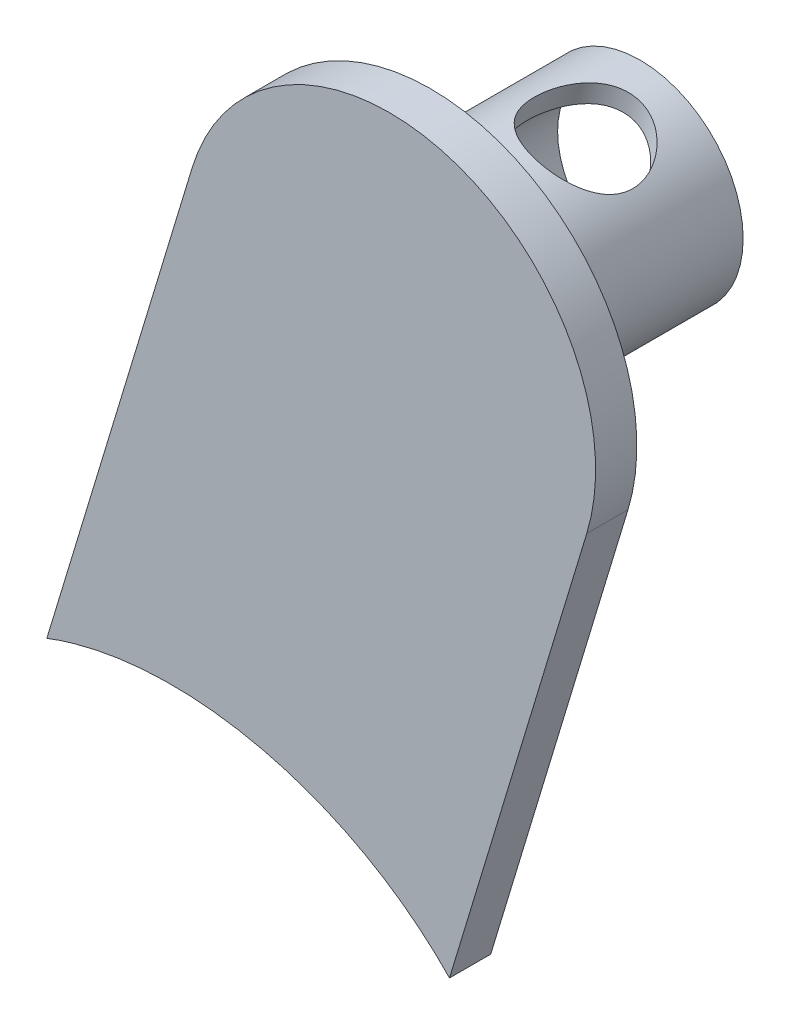
ISO-10303-21;
HEADER;
FILE_DESCRIPTION(('STEP AP214'),'2;1');
FILE_NAME('part.step','',(''),(''),'','','');
FILE_SCHEMA(('AUTOMOTIVE_DESIGN { 1 0 10303 214 1 1 1 1 }'));
ENDSEC;
DATA;
#1=APPLICATION_CONTEXT('core data for automotive mechanical design processes');
#2=APPLICATION_PROTOCOL_DEFINITION('international standard','automotive_design',2000,#1);
#3=PRODUCT_CONTEXT('',#1,'mechanical');
#4=PRODUCT('Part','Part','',(#3));
#5=PRODUCT_RELATED_PRODUCT_CATEGORY('part','',(#4));
#6=PRODUCT_DEFINITION_FORMATION('','',#4);
#7=PRODUCT_DEFINITION_CONTEXT('part definition',#1,'design');
#8=PRODUCT_DEFINITION('design','',#6,#7);
#9=PRODUCT_DEFINITION_SHAPE('','',#8);
#10=(LENGTH_UNIT() NAMED_UNIT(*) SI_UNIT(.MILLI.,.METRE.));
#11=(NAMED_UNIT(*) PLANE_ANGLE_UNIT() SI_UNIT($,.RADIAN.));
#12=(NAMED_UNIT(*) SI_UNIT($,.STERADIAN.) SOLID_ANGLE_UNIT());
#13=UNCERTAINTY_MEASURE_WITH_UNIT(LENGTH_MEASURE(1.E-05),#10,'distance_accuracy_value','');
#14=(GEOMETRIC_REPRESENTATION_CONTEXT(3) GLOBAL_UNCERTAINTY_ASSIGNED_CONTEXT((#13)) GLOBAL_UNIT_ASSIGNED_CONTEXT((#10,
#11,#12)) REPRESENTATION_CONTEXT('',''));
#15=CARTESIAN_POINT('',(0.,0.,0.));
#16=DIRECTION('',(0.,0.,1.));
#17=DIRECTION('',(1.,0.,0.));
#18=AXIS2_PLACEMENT_3D('',#15,#16,#17);
#19=CARTESIAN_POINT('',(1209.34523860419,-251.377000383089,615.999346088971));
#20=CARTESIAN_POINT('',(1202.97437345163,-275.551616764902,615.999346088971));
#21=CARTESIAN_POINT('',(1233.28038668328,-283.53832152006,615.999346088971));
#22=CARTESIAN_POINT('',(1239.65125183585,-259.363705138247,615.999346088971));
#23=CARTESIAN_POINT('',(1246.02211698841,-235.189088756434,615.999346088971));
#24=CARTESIAN_POINT('',(1215.71610375676,-227.202384001276,615.999346088971));
#25=CARTESIAN_POINT('',(1209.34523860419,-251.377000383089,615.999346088971));
#26=(BOUNDED_CURVE() B_SPLINE_CURVE(3,(#19,#20,#21,#22,#23,#24,#25),.UNSPECIFIED.,.T.,
.F.) B_SPLINE_CURVE_WITH_KNOTS((4,3,4),(0.,0.5,1.),
.UNSPECIFIED.) CURVE() GEOMETRIC_REPRESENTATION_ITEM() RATIONAL_B_SPLINE_CURVE((1.,
0.333333333333333,0.333333333333333,1.,0.333333333333333,0.333333333333333,1.)) REPRESENTATION_ITEM(''));
#27=DIRECTION('',(0.,0.,1.));
#28=VECTOR('',#27,1.);
#29=SURFACE_OF_LINEAR_EXTRUSION('',#26,#28);
#30=CARTESIAN_POINT('',(1209.34523860419,-251.377000383089,617.999346088971));
#31=CARTESIAN_POINT('',(1202.97437345163,-275.551616764902,617.999346088971));
#32=CARTESIAN_POINT('',(1233.28038668328,-283.53832152006,617.999346088971));
#33=CARTESIAN_POINT('',(1239.65125183585,-259.363705138247,617.999346088971));
#34=CARTESIAN_POINT('',(1246.02211698841,-235.189088756434,617.999346088971));
#35=CARTESIAN_POINT('',(1215.71610375676,-227.202384001276,617.999346088971));
#36=CARTESIAN_POINT('',(1209.34523860419,-251.377000383089,617.999346088971));
#37=(BOUNDED_CURVE() B_SPLINE_CURVE(3,(#30,#31,#32,#33,#34,#35,#36),.UNSPECIFIED.,.T.,
.F.) B_SPLINE_CURVE_WITH_KNOTS((4,3,4),(0.,0.5,1.),
.UNSPECIFIED.) CURVE() GEOMETRIC_REPRESENTATION_ITEM() RATIONAL_B_SPLINE_CURVE((1.,
0.333333333333333,0.333333333333333,1.,0.333333333333333,0.333333333333333,1.)) REPRESENTATION_ITEM(''));
#38=CARTESIAN_POINT('',(1236.2588408996,-248.221098890482,617.999346088971));
#39=VERTEX_POINT('',#38);
#40=CARTESIAN_POINT('',(1216.72659095181,-243.715486457987,617.999346088971));
#41=VERTEX_POINT('',#40);
#42=EDGE_CURVE('E115',#39,#41,#37,.T.);
#43=ORIENTED_EDGE('',*,*,#42,.T.);
#44=DIRECTION('',(0.,0.,1.));
#45=VECTOR('',#44,1.);
#46=CARTESIAN_POINT('',(1216.72659095181,-243.715486457987,615.999346088971));
#47=LINE('',#46,#45);
#48=CARTESIAN_POINT('',(1216.72659095181,-243.715486457987,615.999346088971));
#49=VERTEX_POINT('',#48);
#50=EDGE_CURVE('E57',#49,#41,#47,.T.);
#51=ORIENTED_EDGE('',*,*,#50,.F.);
#52=CARTESIAN_POINT('',(1236.2588408996,-248.221098890482,615.999346088971));
#53=VERTEX_POINT('',#52);
#54=EDGE_CURVE('E102',#53,#49,#26,.T.);
#55=ORIENTED_EDGE('',*,*,#54,.F.);
#56=DIRECTION('',(0.,0.,1.));
#57=VECTOR('',#56,1.);
#58=CARTESIAN_POINT('',(1236.2588408996,-248.221098890482,615.999346088971));
#59=LINE('',#58,#57);
#60=EDGE_CURVE('E112',#53,#39,#59,.T.);
#61=ORIENTED_EDGE('',*,*,#60,.T.);
#62=EDGE_LOOP('',(#43,#51,#55,#61));
#63=FACE_BOUND('',#62,.T.);
#64=ADVANCED_FACE('F42',(#63),#29,.F.);
#65=CARTESIAN_POINT('',(1216.72659095181,-243.715486457987,615.999346088971));
#66=DIRECTION('',(0.957131671562847,-0.289653177595742,0.));
#67=DIRECTION('',(0.289653177595742,0.957131671562847,0.));
#68=AXIS2_PLACEMENT_3D('',#65,#66,#67);
#69=PLANE('',#68);
#70=DIRECTION('',(0.289653177595742,0.957131671562847,0.));
#71=VECTOR('',#70,1.);
#72=CARTESIAN_POINT('',(1216.72659095181,-243.715486457987,617.999346088971));
#73=LINE('',#72,#71);
#74=CARTESIAN_POINT('',(1223.77520656495,-220.423999376747,617.999346088971));
#75=VERTEX_POINT('',#74);
#76=EDGE_CURVE('E107',#41,#75,#73,.T.);
#77=ORIENTED_EDGE('',*,*,#76,.T.);
#78=DIRECTION('',(0.,0.,1.));
#79=VECTOR('',#78,1.);
#80=CARTESIAN_POINT('',(1223.77520656495,-220.423999376747,615.999346088971));
#81=LINE('',#80,#79);
#82=CARTESIAN_POINT('',(1223.77520656495,-220.423999376747,615.999346088971));
#83=VERTEX_POINT('',#82);
#84=EDGE_CURVE('E105',#83,#75,#81,.T.);
#85=ORIENTED_EDGE('',*,*,#84,.F.);
#86=DIRECTION('',(0.289653177595742,0.957131671562847,0.));
#87=VECTOR('',#86,1.);
#88=CARTESIAN_POINT('',(1216.72659095181,-243.715486457987,615.999346088971));
#89=LINE('',#88,#87);
#90=EDGE_CURVE('E97',#49,#83,#89,.T.);
#91=ORIENTED_EDGE('',*,*,#90,.F.);
#92=ORIENTED_EDGE('',*,*,#50,.T.);
#93=EDGE_LOOP('',(#77,#85,#91,#92));
#94=FACE_BOUND('',#93,.T.);
#95=ADVANCED_FACE('F106',(#94),#69,.F.);
#96=CARTESIAN_POINT('',(1233.34652328058,-223.320531152704,615.999346088971));
#97=DIRECTION('',(0.,0.,1.));
#98=DIRECTION('',(1.,0.,0.));
#99=AXIS2_PLACEMENT_3D('',#96,#97,#98);
#100=CYLINDRICAL_SURFACE('',#99,10.0000000000004);
#101=CARTESIAN_POINT('',(1233.34652328058,-223.320531152704,617.999346088971));
#102=DIRECTION('',(0.,0.,-1.));
#103=DIRECTION('',(1.,0.,0.));
#104=AXIS2_PLACEMENT_3D('',#101,#102,#103);
#105=CIRCLE('',#104,10.0000000000004);
#106=CARTESIAN_POINT('',(1242.91783999621,-226.217062928662,617.999346088971));
#107=VERTEX_POINT('',#106);
#108=EDGE_CURVE('E83',#75,#107,#105,.T.);
#109=ORIENTED_EDGE('',*,*,#108,.T.);
#110=DIRECTION('',(0.,0.,1.));
#111=VECTOR('',#110,1.);
#112=CARTESIAN_POINT('',(1242.91783999621,-226.217062928662,615.999346088971));
#113=LINE('',#112,#111);
#114=CARTESIAN_POINT('',(1242.91783999621,-226.217062928662,615.999346088971));
#115=VERTEX_POINT('',#114);
#116=EDGE_CURVE('E108',#115,#107,#113,.T.);
#117=ORIENTED_EDGE('',*,*,#116,.F.);
#118=CARTESIAN_POINT('',(1233.34652328058,-223.320531152704,615.999346088971));
#119=DIRECTION('',(0.,0.,-1.));
#120=DIRECTION('',(1.,0.,0.));
#121=AXIS2_PLACEMENT_3D('',#118,#119,#120);
#122=CIRCLE('',#121,10.0000000000004);
#123=EDGE_CURVE('E100',#83,#115,#122,.T.);
#124=ORIENTED_EDGE('',*,*,#123,.F.);
#125=ORIENTED_EDGE('',*,*,#84,.T.);
#126=EDGE_LOOP('',(#109,#117,#124,#125));
#127=FACE_BOUND('',#126,.T.);
#128=ADVANCED_FACE('F110',(#127),#100,.T.);
#129=CARTESIAN_POINT('',(1236.2588408996,-248.221098890482,615.999346088971));
#130=DIRECTION('',(-0.957131671562847,0.289653177595743,0.));
#131=DIRECTION('',(-0.289653177595743,-0.957131671562847,0.));
#132=AXIS2_PLACEMENT_3D('',#129,#130,#131);
#133=PLANE('',#132);
#134=DIRECTION('',(-0.289653177595743,-0.957131671562847,0.));
#135=VECTOR('',#134,1.);
#136=CARTESIAN_POINT('',(1236.2588408996,-248.221098890482,617.999346088971));
#137=LINE('',#136,#135);
#138=EDGE_CURVE('E89',#107,#39,#137,.T.);
#139=ORIENTED_EDGE('',*,*,#138,.T.);
#140=ORIENTED_EDGE('',*,*,#60,.F.);
#141=DIRECTION('',(-0.289653177595743,-0.957131671562847,0.));
#142=VECTOR('',#141,1.);
#143=CARTESIAN_POINT('',(1236.2588408996,-248.221098890482,615.999346088971));
#144=LINE('',#143,#142);
#145=EDGE_CURVE('E66',#115,#53,#144,.T.);
#146=ORIENTED_EDGE('',*,*,#145,.F.);
#147=ORIENTED_EDGE('',*,*,#116,.T.);
#148=EDGE_LOOP('',(#139,#140,#146,#147));
#149=FACE_BOUND('',#148,.T.);
#150=ADVANCED_FACE('F168',(#149),#133,.F.);
#151=CARTESIAN_POINT('',(1239.65125183585,-259.363705138247,615.999346088971));
#152=DIRECTION('',(0.,0.,1.));
#153=DIRECTION('',(1.,0.,0.));
#154=AXIS2_PLACEMENT_3D('',#151,#152,#153);
#155=PLANE('',#154);
#156=CARTESIAN_POINT('',(1233.50419133506,-222.034079566292,615.999346088971));
#157=DIRECTION('',(0.,0.,1.));
#158=DIRECTION('',(1.,0.,0.));
#159=AXIS2_PLACEMENT_3D('',#156,#157,#158);
#160=CIRCLE('',#159,4.99999999999999);
#161=CARTESIAN_POINT('',(1238.50419133506,-222.034079566292,615.999346088971));
#162=VERTEX_POINT('',#161);
#163=EDGE_CURVE('E12',#162,#162,#160,.F.);
#164=ORIENTED_EDGE('',*,*,#163,.F.);
#165=EDGE_LOOP('',(#164));
#166=FACE_BOUND('',#165,.T.);
#167=ORIENTED_EDGE('',*,*,#54,.T.);
#168=ORIENTED_EDGE('',*,*,#90,.T.);
#169=ORIENTED_EDGE('',*,*,#123,.T.);
#170=ORIENTED_EDGE('',*,*,#145,.T.);
#171=EDGE_LOOP('',(#167,#168,#169,#170));
#172=FACE_BOUND('',#171,.T.);
#173=ADVANCED_FACE('F98',(#166,#172),#155,.F.);
#174=CARTESIAN_POINT('',(1239.65125183585,-259.363705138247,617.999346088971));
#175=DIRECTION('',(0.,0.,1.));
#176=DIRECTION('',(1.,0.,0.));
#177=AXIS2_PLACEMENT_3D('',#174,#175,#176);
#178=PLANE('',#177);
#179=ORIENTED_EDGE('',*,*,#42,.F.);
#180=ORIENTED_EDGE('',*,*,#138,.F.);
#181=ORIENTED_EDGE('',*,*,#108,.F.);
#182=ORIENTED_EDGE('',*,*,#76,.F.);
#183=EDGE_LOOP('',(#179,#180,#181,#182));
#184=FACE_BOUND('',#183,.T.);
#185=ADVANCED_FACE('F167',(#184),#178,.T.);
#186=CARTESIAN_POINT('',(1233.50419133506,-222.034079566292,605.999346088971));
#187=DIRECTION('',(0.,0.,-1.));
#188=DIRECTION('',(-1.,0.,0.));
#189=AXIS2_PLACEMENT_3D('',#186,#187,#188);
#190=PLANE('',#189);
#191=CARTESIAN_POINT('',(1233.50419133506,-222.034079566292,605.999346088971));
#192=DIRECTION('',(0.,0.,-1.));
#193=DIRECTION('',(-1.,0.,0.));
#194=AXIS2_PLACEMENT_3D('',#191,#192,#193);
#195=CIRCLE('',#194,4.99999999999999);
#196=CARTESIAN_POINT('',(1228.50419133506,-222.034079566292,605.999346088971));
#197=VERTEX_POINT('',#196);
#198=EDGE_CURVE('E120',#197,#197,#195,.T.);
#199=ORIENTED_EDGE('',*,*,#198,.T.);
#200=EDGE_LOOP('',(#199));
#201=FACE_BOUND('',#200,.T.);
#202=CARTESIAN_POINT('',(1233.50419133506,-222.034079566292,605.999346088971));
#203=DIRECTION('',(0.,0.,-1.));
#204=DIRECTION('',(-1.,0.,0.));
#205=AXIS2_PLACEMENT_3D('',#202,#203,#204);
#206=CIRCLE('',#205,3.99999999999999);
#207=CARTESIAN_POINT('',(1229.50419133506,-222.034079566292,605.999346088971));
#208=VERTEX_POINT('',#207);
#209=EDGE_CURVE('E194',#208,#208,#206,.T.);
#210=ORIENTED_EDGE('',*,*,#209,.F.);
#211=EDGE_LOOP('',(#210));
#212=FACE_BOUND('',#211,.T.);
#213=ADVANCED_FACE('F162',(#201,#212),#190,.T.);
#214=CARTESIAN_POINT('',(1233.50419133506,-222.034079566292,605.999346088971));
#215=DIRECTION('',(0.,0.,1.));
#216=DIRECTION('',(1.,0.,0.));
#217=AXIS2_PLACEMENT_3D('',#214,#215,#216);
#218=CYLINDRICAL_SURFACE('',#217,4.99999999999999);
#219=CARTESIAN_POINT('',(1229.85712710573,-225.454448334003,609.999346088971));
#220=CARTESIAN_POINT('',(1229.85713346192,-225.45446363482,610.129612595847));
#221=CARTESIAN_POINT('',(1229.8652093745,-225.463129956198,610.260048809647));
#222=CARTESIAN_POINT('',(1229.89726546085,-225.496822810688,610.5169150605));
#223=CARTESIAN_POINT('',(1229.92127905486,-225.521883720555,610.643336093028));
#224=CARTESIAN_POINT('',(1229.98436388379,-225.585528822294,610.887975034532));
#225=CARTESIAN_POINT('',(1230.02335509881,-225.624041051171,611.006232662533));
#226=CARTESIAN_POINT('',(1230.11564871106,-225.711279430452,611.232906652065));
#227=CARTESIAN_POINT('',(1230.16895188252,-225.76000613339,611.341322480766));
#228=CARTESIAN_POINT('',(1230.29423640167,-225.868607456126,611.555110392888));
#229=CARTESIAN_POINT('',(1230.3673956863,-225.929070064407,611.65949392346));
#230=CARTESIAN_POINT('',(1230.52914639338,-226.053974070613,611.852867064684));
#231=CARTESIAN_POINT('',(1230.61774546957,-226.118417431579,611.941848996726));
#232=CARTESIAN_POINT('',(1230.81605656543,-226.251796173768,612.107763965456));
#233=CARTESIAN_POINT('',(1230.92678917981,-226.320741535936,612.18348050825));
#234=CARTESIAN_POINT('',(1231.16312868173,-226.454236992392,612.312198222455));
#235=CARTESIAN_POINT('',(1231.28872611808,-226.518789838794,612.365213729409));
#236=CARTESIAN_POINT('',(1231.54228809192,-226.635055746977,612.443107742135));
#237=CARTESIAN_POINT('',(1231.6694483061,-226.687355588234,612.469719904836));
#238=CARTESIAN_POINT('',(1231.93007799565,-226.781851268447,612.499761385682));
#239=CARTESIAN_POINT('',(1232.06354360422,-226.824053206065,612.503204730966));
#240=CARTESIAN_POINT('',(1232.32045224235,-226.893599835504,612.487479404039));
#241=CARTESIAN_POINT('',(1232.44375755329,-226.921917386082,612.470251050166));
#242=CARTESIAN_POINT('',(1232.68819163269,-226.968614035379,612.41714397921));
#243=CARTESIAN_POINT('',(1232.80932023757,-226.986992390199,612.381263866531));
#244=CARTESIAN_POINT('',(1233.04775419072,-227.014670277677,612.291639673746));
#245=CARTESIAN_POINT('',(1233.16498345622,-227.023840682919,612.23765530604));
#246=CARTESIAN_POINT('',(1233.39101547488,-227.03408065739,612.113687548467));
#247=CARTESIAN_POINT('',(1233.49981519252,-227.03514732171,612.043698430715));
#248=CARTESIAN_POINT('',(1233.71638966128,-227.030856834818,611.882107710138));
#249=CARTESIAN_POINT('',(1233.82309535293,-227.024882925958,611.789088518156));
#250=CARTESIAN_POINT('',(1234.02079621302,-227.008311326233,611.587871776645));
#251=CARTESIAN_POINT('',(1234.11177928799,-226.997710098042,611.479662658285));
#252=CARTESIAN_POINT('',(1234.28028589007,-226.974258955158,611.24272560791));
#253=CARTESIAN_POINT('',(1234.35658777301,-226.961308992198,611.113131031335));
#254=CARTESIAN_POINT('',(1234.4842000931,-226.937531251406,610.842001910573));
#255=CARTESIAN_POINT('',(1234.5355366062,-226.926701266385,610.700480006427));
#256=CARTESIAN_POINT('',(1234.60675453659,-226.911127279723,610.421309810764));
#257=CARTESIAN_POINT('',(1234.62880624595,-226.905969001428,610.284243291362));
#258=CARTESIAN_POINT('',(1234.64704642204,-226.901727069698,610.008342735179));
#259=CARTESIAN_POINT('',(1234.64325315813,-226.902639125242,609.869510016171));
#260=CARTESIAN_POINT('',(1234.61199393971,-226.909831875773,609.610211292524));
#261=CARTESIAN_POINT('',(1234.58716295615,-226.915514375916,609.489397461201));
#262=CARTESIAN_POINT('',(1234.51875100043,-226.930188543718,609.253426623293));
#263=CARTESIAN_POINT('',(1234.4751639562,-226.939181282895,609.138271462104));
#264=CARTESIAN_POINT('',(1234.36884039314,-226.95905910591,608.910817761714));
#265=CARTESIAN_POINT('',(1234.30531046076,-226.970012543783,608.798898546838));
#266=CARTESIAN_POINT('',(1234.16230266122,-226.991106029033,608.585672910122));
#267=CARTESIAN_POINT('',(1234.08281660271,-227.001245654868,608.484371980182));
#268=CARTESIAN_POINT('',(1233.89920140789,-227.01940815373,608.281899170167));
#269=CARTESIAN_POINT('',(1233.79322891156,-227.027003082793,608.182353212198));
#270=CARTESIAN_POINT('',(1233.5668657874,-227.034969068679,608.000815493965));
#271=CARTESIAN_POINT('',(1233.44647031062,-227.03533768915,607.918829663312));
#272=CARTESIAN_POINT('',(1233.19120177457,-227.025948254243,607.77291177418));
#273=CARTESIAN_POINT('',(1233.05603048412,-227.015922680379,607.709513293762));
#274=CARTESIAN_POINT('',(1232.77838730831,-226.983087703896,607.606501329009));
#275=CARTESIAN_POINT('',(1232.63592195328,-226.96028956076,607.566866959366));
#276=CARTESIAN_POINT('',(1232.36217381874,-226.903732134007,607.515924679614));
#277=CARTESIAN_POINT('',(1232.23106436162,-226.871170493164,607.50235140314));
#278=CARTESIAN_POINT('',(1231.97156988355,-226.79531014858,607.497237921476));
#279=CARTESIAN_POINT('',(1231.84318392473,-226.752015208297,607.50569000331));
#280=CARTESIAN_POINT('',(1231.6014861362,-226.659592173923,607.542887119366));
#281=CARTESIAN_POINT('',(1231.48773846698,-226.611036442564,607.570258260607));
#282=CARTESIAN_POINT('',(1231.26880790762,-226.508193793462,607.642663538729));
#283=CARTESIAN_POINT('',(1231.16362624834,-226.453906054645,607.687700208604));
#284=CARTESIAN_POINT('',(1230.95940622812,-226.339697379735,607.79616390771));
#285=CARTESIAN_POINT('',(1230.86082302766,-226.279634818516,607.860295113661));
#286=CARTESIAN_POINT('',(1230.67623342783,-226.158983648785,608.004240199118));
#287=CARTESIAN_POINT('',(1230.59023283669,-226.098394810926,608.084061281598));
#288=CARTESIAN_POINT('',(1230.42366610614,-225.973904593847,608.26634188342));
#289=CARTESIAN_POINT('',(1230.3444925776,-225.910273638088,608.370263814971));
#290=CARTESIAN_POINT('',(1230.20296444973,-225.79047613363,608.592961374353));
#291=CARTESIAN_POINT('',(1230.14062472418,-225.734316208159,608.71175000317));
#292=CARTESIAN_POINT('',(1230.03193996236,-225.632582559198,608.965982206635));
#293=CARTESIAN_POINT('',(1229.98616264614,-225.58739946563,609.101833477395));
#294=CARTESIAN_POINT('',(1229.93258494056,-225.53325913042,609.312568738491));
#295=CARTESIAN_POINT('',(1229.91724749325,-225.517492856105,609.383905864668));
#296=CARTESIAN_POINT('',(1229.89167859121,-225.490970655211,609.52838678582));
#297=CARTESIAN_POINT('',(1229.88144356648,-225.480211225855,609.601529279925));
#298=CARTESIAN_POINT('',(1229.86826218803,-225.466292146944,609.728847075518));
#299=CARTESIAN_POINT('',(1229.86408991231,-225.461860741917,609.782762410483));
#300=CARTESIAN_POINT('',(1229.85852095498,-225.45593555159,609.890890705281));
#301=CARTESIAN_POINT('',(1229.85712445904,-225.45444196281,609.945103684781));
#302=CARTESIAN_POINT('',(1229.85712710573,-225.454448334003,609.999346088971));
#303=B_SPLINE_CURVE_WITH_KNOTS('',3,(#219,#220,#221,#222,#223,#224,#225,#226,#227,#228,#229,
#230,#231,#232,#233,#234,#235,#236,#237,#238,#239,#240,#241,#242,#243,#244,#245,#246,#247,#248,
#249,#250,#251,#252,#253,#254,#255,#256,#257,#258,#259,#260,#261,#262,#263,#264,#265,#266,#267,
#268,#269,#270,#271,#272,#273,#274,#275,#276,#277,#278,#279,#280,#281,#282,#283,#284,#285,#286,
#287,#288,#289,#290,#291,#292,#293,#294,#295,#296,#297,#298,#299,#300,#301,#302),.UNSPECIFIED.,
.T.,.F.,(4,2,2,2,2,2,2,2,2,2,2,2,2,2,2,2,2,2,2,2,2,2,2,2,2,2,2,2,2,2,2,2,2,2,2,2,2,2,2,2,2,4),
(0.,0.390580306486961,0.781982232062044,1.17132148982686,1.56068181366368,1.98215578129642,
2.40383927716021,2.85394730601997,3.30377067414797,3.72158712424921,4.13915059220192,
4.52040243716431,4.90168281298729,5.28823836832947,5.67493248380769,6.09817978647322,
6.52175120619908,6.97222104328716,7.4222193553435,7.83655727140615,8.25060232976027,
8.61935458565149,8.98822631095238,9.37418241020294,9.76033715555214,10.1951685895663,
10.6301466245059,11.0766045353749,11.5226694952702,11.9278067597883,12.3328021699002,
12.7111106218385,13.0894733378514,13.484018768038,13.878745752569,14.3127560463027,
14.7471485711798,15.1952687260161,15.418924415395,15.6424233996907,15.8050484542807,
15.967684387038),.UNSPECIFIED.);
#304=CARTESIAN_POINT('',(1229.85712710573,-225.454448334003,609.999346088971));
#305=VERTEX_POINT('',#304);
#306=EDGE_CURVE('E153',#305,#305,#303,.T.);
#307=ORIENTED_EDGE('',*,*,#306,.T.);
#308=EDGE_LOOP('',(#307));
#309=FACE_BOUND('',#308,.T.);
#310=CARTESIAN_POINT('',(1232.36559720658,-217.165444910602,609.999346088971));
#311=CARTESIAN_POINT('',(1232.36561098009,-217.16543570156,609.869079582094));
#312=CARTESIAN_POINT('',(1232.37713700782,-217.162701442056,609.738643368294));
#313=CARTESIAN_POINT('',(1232.42249590927,-217.152436395753,609.481777117441));
#314=CARTESIAN_POINT('',(1232.45637565634,-217.144895531147,609.355356084913));
#315=CARTESIAN_POINT('',(1232.54416443791,-217.126908745808,609.11071714341));
#316=CARTESIAN_POINT('',(1232.59796697818,-217.116478343997,608.992459515408));
#317=CARTESIAN_POINT('',(1232.72314519243,-217.095052650113,608.765785525876));
#318=CARTESIAN_POINT('',(1232.79452181709,-217.084057327507,608.657369697175));
#319=CARTESIAN_POINT('',(1232.95900029628,-217.063145897093,608.443581785054));
#320=CARTESIAN_POINT('',(1233.0534084558,-217.053393597645,608.339198254481));
#321=CARTESIAN_POINT('',(1233.25727356121,-217.039134537182,608.145825113257));
#322=CARTESIAN_POINT('',(1233.366737965,-217.034630386302,608.056843181216));
#323=CARTESIAN_POINT('',(1233.60572770947,-217.033590361688,607.890928212485));
#324=CARTESIAN_POINT('',(1233.73610792532,-217.037612073448,607.815211669691));
#325=CARTESIAN_POINT('',(1234.006809703,-217.05756062284,607.686493955487));
#326=CARTESIAN_POINT('',(1234.1471249255,-217.073479929735,607.633478448532));
#327=CARTESIAN_POINT('',(1234.42260597,-217.117316331297,607.555584435807));
#328=CARTESIAN_POINT('',(1234.55742778555,-217.144299131746,607.528972273106));
#329=CARTESIAN_POINT('',(1234.82671960585,-217.210171615878,607.498930792259));
#330=CARTESIAN_POINT('',(1234.96118977421,-217.249054080214,607.495487446975));
#331=CARTESIAN_POINT('',(1235.21355136625,-217.333625995595,607.511212773902));
#332=CARTESIAN_POINT('',(1235.33186760361,-217.37842947039,607.528441127775));
#333=CARTESIAN_POINT('',(1235.56117815732,-217.475100387357,607.581548198731));
#334=CARTESIAN_POINT('',(1235.67217192506,-217.526968357907,607.617428311411));
#335=CARTESIAN_POINT('',(1235.8859437816,-217.636139823131,607.707052504196));
#336=CARTESIAN_POINT('',(1235.98858695657,-217.693508592111,607.761036871901));
#337=CARTESIAN_POINT('',(1236.182369055,-217.810315393574,607.885004629474));
#338=CARTESIAN_POINT('',(1236.27350384159,-217.869754160408,607.954993747226));
#339=CARTESIAN_POINT('',(1236.45135860673,-217.993409290987,608.116584467803));
#340=CARTESIAN_POINT('',(1236.53684693662,-218.057546157681,608.209603659786));
#341=CARTESIAN_POINT('',(1236.69218550664,-218.180956759589,608.410820401296));
#342=CARTESIAN_POINT('',(1236.76202372119,-218.240226733072,608.519029519656));
#343=CARTESIAN_POINT('',(1236.88925225195,-218.353175093004,608.755966570031));
#344=CARTESIAN_POINT('',(1236.94557043931,-218.406259371773,608.885561146606));
#345=CARTESIAN_POINT('',(1237.03858557425,-218.496804774017,609.156690267368));
#346=CARTESIAN_POINT('',(1237.07530299846,-218.534282192719,609.298212171515));
#347=CARTESIAN_POINT('',(1237.1259353611,-218.586731277776,609.577382367178));
#348=CARTESIAN_POINT('',(1237.14142671609,-218.603251073204,609.714448886579));
#349=CARTESIAN_POINT('',(1237.15425419413,-218.616894892896,609.990349442762));
#350=CARTESIAN_POINT('',(1237.15160314172,-218.614032618008,610.12918216177));
#351=CARTESIAN_POINT('',(1237.12957733742,-218.590714420368,610.388480885417));
#352=CARTESIAN_POINT('',(1237.11206373125,-218.572217335425,610.50929471674));
#353=CARTESIAN_POINT('',(1237.06326758178,-218.522072917167,610.745265554648));
#354=CARTESIAN_POINT('',(1237.03198057941,-218.490421325338,610.860420715837));
#355=CARTESIAN_POINT('',(1236.9545195952,-218.414925472229,611.087874416227));
#356=CARTESIAN_POINT('',(1236.9077232334,-218.370584400628,611.199793631103));
#357=CARTESIAN_POINT('',(1236.80040760277,-218.273736472043,611.413019267819));
#358=CARTESIAN_POINT('',(1236.73988128334,-218.221225423993,611.514320197759));
#359=CARTESIAN_POINT('',(1236.59714694293,-218.104300985999,611.716793007774));
#360=CARTESIAN_POINT('',(1236.51316759076,-218.039221639545,611.816338965743));
#361=CARTESIAN_POINT('',(1236.32920464928,-217.907080211246,611.997876683977));
#362=CARTESIAN_POINT('',(1236.22921567377,-217.84001746833,612.079862514629));
#363=CARTESIAN_POINT('',(1236.01157448572,-217.70629200236,612.225780403762));
#364=CARTESIAN_POINT('',(1235.89352575294,-217.639686547772,612.289178884179));
#365=CARTESIAN_POINT('',(1235.64426443617,-217.513066388559,612.392190848933));
#366=CARTESIAN_POINT('',(1235.51306352982,-217.453045934666,612.431825218576));
#367=CARTESIAN_POINT('',(1235.25389022911,-217.348327340875,612.482767498327));
#368=CARTESIAN_POINT('',(1235.12672613395,-217.302728622668,612.496340774801));
#369=CARTESIAN_POINT('',(1234.86871181937,-217.221977217082,612.501454256465));
#370=CARTESIAN_POINT('',(1234.7378629062,-217.18682087773,612.493002174632));
#371=CARTESIAN_POINT('',(1234.4854754782,-217.12972075116,612.455805058575));
#372=CARTESIAN_POINT('',(1234.36389161622,-217.107058981495,612.428433917334));
#373=CARTESIAN_POINT('',(1234.12467373413,-217.071253881474,612.356028639212));
#374=CARTESIAN_POINT('',(1234.00704028309,-217.058111916898,612.310991969337));
#375=CARTESIAN_POINT('',(1233.7737623939,-217.039922235953,612.202528270231));
#376=CARTESIAN_POINT('',(1233.65841821399,-217.035244754251,612.138397064281));
#377=CARTESIAN_POINT('',(1233.43790461539,-217.033301058336,611.994451978823));
#378=CARTESIAN_POINT('',(1233.33273990314,-217.036038255488,611.914630896344));
#379=CARTESIAN_POINT('',(1233.1250963277,-217.047282607407,611.732350294521));
#380=CARTESIAN_POINT('',(1233.02392634051,-217.056336879579,611.62842836297));
#381=CARTESIAN_POINT('',(1232.83972192204,-217.077559161947,611.405730803589));
#382=CARTESIAN_POINT('',(1232.75670354114,-217.089729907377,611.286942174772));
#383=CARTESIAN_POINT('',(1232.60984735039,-217.114130153718,611.032709971306));
#384=CARTESIAN_POINT('',(1232.54669859188,-217.12634935673,610.896858700546));
#385=CARTESIAN_POINT('',(1232.47209178935,-217.141697693728,610.686123439451));
#386=CARTESIAN_POINT('',(1232.450585969,-217.146314227762,610.614786313273));
#387=CARTESIAN_POINT('',(1232.41460164572,-217.154208806321,610.470305392121));
#388=CARTESIAN_POINT('',(1232.40011822965,-217.157487786396,610.397162898016));
#389=CARTESIAN_POINT('',(1232.38143091325,-217.161762561391,610.269845102424));
#390=CARTESIAN_POINT('',(1232.37550164471,-217.163136973862,610.215929767458));
#391=CARTESIAN_POINT('',(1232.36758179201,-217.164980096065,610.10780147266));
#392=CARTESIAN_POINT('',(1232.36559147135,-217.165448745207,610.05358849316));
#393=CARTESIAN_POINT('',(1232.36559720658,-217.165444910602,609.999346088971));
#394=B_SPLINE_CURVE_WITH_KNOTS('',3,(#310,#311,#312,#313,#314,#315,#316,#317,#318,#319,#320,
#321,#322,#323,#324,#325,#326,#327,#328,#329,#330,#331,#332,#333,#334,#335,#336,#337,#338,#339,
#340,#341,#342,#343,#344,#345,#346,#347,#348,#349,#350,#351,#352,#353,#354,#355,#356,#357,#358,
#359,#360,#361,#362,#363,#364,#365,#366,#367,#368,#369,#370,#371,#372,#373,#374,#375,#376,#377,
#378,#379,#380,#381,#382,#383,#384,#385,#386,#387,#388,#389,#390,#391,#392,#393),.UNSPECIFIED.,
.T.,.F.,(4,2,2,2,2,2,2,2,2,2,2,2,2,2,2,2,2,2,2,2,2,2,2,2,2,2,2,2,2,2,2,2,2,2,2,2,2,2,2,2,2,4),
(0.,0.39058030648694,0.781982232062027,1.17132148982693,1.56068181366372,1.98215578129652,
2.4038392771603,2.85394730602007,3.30377067414811,3.72158712424921,4.13915059220189,
4.52040243716431,4.90168281298725,5.28823836832958,5.67493248380769,6.09817978647315,
6.52175120619882,6.97222104328699,7.42221935534348,7.83655727140601,8.25060232976025,
8.61935458565136,8.98822631095232,9.37418241020297,9.7603371555521,10.1951685895661,
10.6301466245058,11.0766045353751,11.5226694952702,11.927806759788,12.3328021699002,
12.7111106218384,13.0894733378513,13.4840187680378,13.8787457525687,14.3127560463023,
14.7471485711798,15.1952687260161,15.418924415395,15.6424233996908,15.8050484542808,
15.9676843870379),.UNSPECIFIED.);
#395=CARTESIAN_POINT('',(1232.36559720658,-217.165444910602,609.999346088971));
#396=VERTEX_POINT('',#395);
#397=EDGE_CURVE('E147',#396,#396,#394,.T.);
#398=ORIENTED_EDGE('',*,*,#397,.T.);
#399=EDGE_LOOP('',(#398));
#400=FACE_BOUND('',#399,.T.);
#401=ORIENTED_EDGE('',*,*,#198,.F.);
#402=EDGE_LOOP('',(#401));
#403=FACE_BOUND('',#402,.T.);
#404=ORIENTED_EDGE('',*,*,#163,.T.);
#405=EDGE_LOOP('',(#404));
#406=FACE_BOUND('',#405,.T.);
#407=ADVANCED_FACE('F158',(#309,#400,#403,#406),#218,.T.);
#408=CARTESIAN_POINT('',(1233.50419133506,-222.034079566292,605.999346088971));
#409=DIRECTION('',(0.,0.,1.));
#410=DIRECTION('',(1.,0.,0.));
#411=AXIS2_PLACEMENT_3D('',#408,#409,#410);
#412=CYLINDRICAL_SURFACE('',#411,3.99999999999999);
#413=CARTESIAN_POINT('',(1230.206920399,-224.29858930886,609.999346088971));
#414=CARTESIAN_POINT('',(1230.20692069735,-224.298590356546,610.061502840416));
#415=CARTESIAN_POINT('',(1230.20860447962,-224.301048434926,610.123672035642));
#416=CARTESIAN_POINT('',(1230.21531749797,-224.310774130174,610.247463268519));
#417=CARTESIAN_POINT('',(1230.22034870448,-224.318044579771,610.309084962228));
#418=CARTESIAN_POINT('',(1230.24043083985,-224.346750855939,610.492572136714));
#419=CARTESIAN_POINT('',(1230.26047013837,-224.375080577361,610.61289442016));
#420=CARTESIAN_POINT('',(1230.31296869097,-224.44613006772,610.844944286849));
#421=CARTESIAN_POINT('',(1230.34532039666,-224.488724855661,610.956736504026));
#422=CARTESIAN_POINT('',(1230.42194765658,-224.584280761978,611.171354614305));
#423=CARTESIAN_POINT('',(1230.46622353608,-224.637242163113,611.274180262724));
#424=CARTESIAN_POINT('',(1230.57323422555,-224.757457434247,611.483080070274));
#425=CARTESIAN_POINT('',(1230.6376485376,-224.825675534225,611.587739413975));
#426=CARTESIAN_POINT('',(1230.78155054274,-224.966208511313,611.783107640594));
#427=CARTESIAN_POINT('',(1230.86105123579,-225.038526883664,611.873804368924));
#428=CARTESIAN_POINT('',(1231.04577327619,-225.19195923416,612.049566387143));
#429=CARTESIAN_POINT('',(1231.15294051556,-225.273081783782,612.132632273421));
#430=CARTESIAN_POINT('',(1231.32705310245,-225.390417682239,612.239891243707));
#431=CARTESIAN_POINT('',(1231.3873368832,-225.428815430716,612.272761227304));
#432=CARTESIAN_POINT('',(1231.51210700244,-225.503498572508,612.332300774334));
#433=CARTESIAN_POINT('',(1231.57659039882,-225.539785411626,612.358974620009));
#434=CARTESIAN_POINT('',(1231.70263044642,-225.606043441992,612.403329904227));
#435=CARTESIAN_POINT('',(1231.76382324832,-225.636282184561,612.421648065489));
#436=CARTESIAN_POINT('',(1231.88882578006,-225.694042722028,612.452648375284));
#437=CARTESIAN_POINT('',(1231.95263397551,-225.721566078591,612.465333778187));
#438=CARTESIAN_POINT('',(1232.08234051427,-225.773493067461,612.484859886605));
#439=CARTESIAN_POINT('',(1232.1482375392,-225.79789862052,612.491704205484));
#440=CARTESIAN_POINT('',(1232.28151781843,-225.843283764409,612.49944530236));
#441=CARTESIAN_POINT('',(1232.34890090076,-225.864263749305,612.500342764934));
#442=CARTESIAN_POINT('',(1232.53407556546,-225.91656281421,612.494620715423));
#443=CARTESIAN_POINT('',(1232.65277880593,-225.944258463993,612.482039585892));
#444=CARTESIAN_POINT('',(1232.88909655975,-225.988336842501,612.439615871004));
#445=CARTESIAN_POINT('',(1233.00671099013,-226.00471871597,612.409771980997));
#446=CARTESIAN_POINT('',(1233.23801715175,-226.026908998931,612.334137529687));
#447=CARTESIAN_POINT('',(1233.35169802105,-226.03269011754,612.2883061694));
#448=CARTESIAN_POINT('',(1233.57226344958,-226.035023569675,612.182408849986));
#449=CARTESIAN_POINT('',(1233.6791464534,-226.031573798835,612.122339647907));
#450=CARTESIAN_POINT('',(1233.89695569771,-226.016425957498,611.981289672047));
#451=CARTESIAN_POINT('',(1234.0067298087,-226.003754839249,611.89863681228));
#452=CARTESIAN_POINT('',(1234.21310507505,-225.972146299241,611.719081351763));
#453=CARTESIAN_POINT('',(1234.30968668685,-225.953199720118,611.622158042587));
#454=CARTESIAN_POINT('',(1234.49893317155,-225.909783483197,611.401934835797));
#455=CARTESIAN_POINT('',(1234.58943949034,-225.884915676964,611.276843325613));
#456=CARTESIAN_POINT('',(1234.74637918388,-225.83719939573,611.012053851669));
#457=CARTESIAN_POINT('',(1234.8128568839,-225.81434726195,610.872383401517));
#458=CARTESIAN_POINT('',(1234.90300457215,-225.781743902219,610.619807282864));
#459=CARTESIAN_POINT('',(1234.93333493045,-225.770127777747,610.509524163757));
#460=CARTESIAN_POINT('',(1234.97616311435,-225.753467594674,610.28511571141));
#461=CARTESIAN_POINT('',(1234.9886853021,-225.748414558377,610.170995846314));
#462=CARTESIAN_POINT('',(1234.99492158492,-225.745917268116,609.941888728468));
#463=CARTESIAN_POINT('',(1234.98859257849,-225.748490450725,609.826900088492));
#464=CARTESIAN_POINT('',(1234.95757319164,-225.760732478692,609.599784924652));
#465=CARTESIAN_POINT('',(1234.93286760546,-225.770407200154,609.487660850599));
#466=CARTESIAN_POINT('',(1234.86743614302,-225.794763185254,609.270909329545));
#467=CARTESIAN_POINT('',(1234.82698106569,-225.80935928987,609.166188773076));
#468=CARTESIAN_POINT('',(1234.73211425182,-225.841270746812,608.963771389077));
#469=CARTESIAN_POINT('',(1234.67769756199,-225.858587063367,608.866077070093));
#470=CARTESIAN_POINT('',(1234.5452315612,-225.89695938963,608.660734147307));
#471=CARTESIAN_POINT('',(1234.4646553555,-225.918099716148,608.554731561669));
#472=CARTESIAN_POINT('',(1234.28879976705,-225.9574099389,608.354975428316));
#473=CARTESIAN_POINT('',(1234.19350514114,-225.975576714929,608.261234767728));
#474=CARTESIAN_POINT('',(1233.97398837476,-226.008183039181,608.073382018329));
#475=CARTESIAN_POINT('',(1233.84757782745,-226.021558448131,607.981618690485));
#476=CARTESIAN_POINT('',(1233.58101165395,-226.035557207504,607.819199074251));
#477=CARTESIAN_POINT('',(1233.44086251058,-226.036186543579,607.748532893844));
#478=CARTESIAN_POINT('',(1233.2282711233,-226.025138072026,607.662765020996));
#479=CARTESIAN_POINT('',(1233.15924665829,-226.019796832362,607.638048645019));
#480=CARTESIAN_POINT('',(1233.01980243011,-226.005259046195,607.594407812238));
#481=CARTESIAN_POINT('',(1232.94938349985,-225.996064738649,607.57548000282));
#482=CARTESIAN_POINT('',(1232.80786960331,-225.973655938277,607.543740258831));
#483=CARTESIAN_POINT('',(1232.73677528219,-225.960444968765,607.530922989454));
#484=CARTESIAN_POINT('',(1232.59462372554,-225.92997252009,607.511606916678));
#485=CARTESIAN_POINT('',(1232.52356648583,-225.912711711573,607.50510706804));
#486=CARTESIAN_POINT('',(1232.33247561484,-225.860641931893,607.496274573464));
#487=CARTESIAN_POINT('',(1232.21311547244,-225.822025303364,607.500080296061));
#488=CARTESIAN_POINT('',(1231.98042811315,-225.734570309921,607.526263678516));
#489=CARTESIAN_POINT('',(1231.86710062276,-225.685732408905,607.54864049565));
#490=CARTESIAN_POINT('',(1231.65311485778,-225.581920214675,607.609668504517));
#491=CARTESIAN_POINT('',(1231.55215345315,-225.527217589617,607.647728162535));
#492=CARTESIAN_POINT('',(1231.36019320149,-225.412803660813,607.738465551414));
#493=CARTESIAN_POINT('',(1231.26919603889,-225.353091513224,607.791145748538));
#494=CARTESIAN_POINT('',(1231.0891349917,-225.224840133688,607.915667367691));
#495=CARTESIAN_POINT('',(1231.00125210961,-225.156027995589,607.988930079728));
#496=CARTESIAN_POINT('',(1230.8389959459,-225.018716488612,608.149499321485));
#497=CARTESIAN_POINT('',(1230.76463811212,-224.950217563414,608.236821697805));
#498=CARTESIAN_POINT('',(1230.61976466867,-224.807496235703,608.437578604033));
#499=CARTESIAN_POINT('',(1230.5513477912,-224.733872024969,608.552962701542));
#500=CARTESIAN_POINT('',(1230.4323956163,-224.597719613539,608.798635498731));
#501=CARTESIAN_POINT('',(1230.38185042671,-224.535185284057,608.928915900124));
#502=CARTESIAN_POINT('',(1230.30829035754,-224.44011479927,609.172151389756));
#503=CARTESIAN_POINT('',(1230.2816657513,-224.404005967813,609.282616661125));
#504=CARTESIAN_POINT('',(1230.24019330945,-224.346568272936,609.509285431973));
#505=CARTESIAN_POINT('',(1230.22530818835,-224.325192643255,609.625469508771));
#506=CARTESIAN_POINT('',(1230.21330848141,-224.30786693057,609.785406083617));
#507=CARTESIAN_POINT('',(1230.21091529473,-224.304396324004,609.828071614679));
#508=CARTESIAN_POINT('',(1230.20772095045,-224.299756862399,609.913604787922));
#509=CARTESIAN_POINT('',(1230.20692019321,-224.298588586201,609.956472478214));
#510=CARTESIAN_POINT('',(1230.206920399,-224.29858930886,609.999346088971));
#511=B_SPLINE_CURVE_WITH_KNOTS('',3,(#413,#414,#415,#416,#417,#418,#419,#420,#421,#422,#423,
#424,#425,#426,#427,#428,#429,#430,#431,#432,#433,#434,#435,#436,#437,#438,#439,#440,#441,#442,
#443,#444,#445,#446,#447,#448,#449,#450,#451,#452,#453,#454,#455,#456,#457,#458,#459,#460,#461,
#462,#463,#464,#465,#466,#467,#468,#469,#470,#471,#472,#473,#474,#475,#476,#477,#478,#479,#480,
#481,#482,#483,#484,#485,#486,#487,#488,#489,#490,#491,#492,#493,#494,#495,#496,#497,#498,#499,
#500,#501,#502,#503,#504,#505,#506,#507,#508,#509,#510),.UNSPECIFIED.,.T.,.F.,(4,2,2,2,2,2,2,2,
2,2,2,2,2,2,2,2,2,2,2,2,2,2,2,2,2,2,2,2,2,2,2,2,2,2,2,2,2,2,2,2,2,2,2,2,2,2,2,2,4),(0.,
0.186415315858525,0.372940459994571,0.746478880764758,1.11682668423136,1.48718459072622,
1.90722798685084,2.32763499192889,2.79876029265969,3.03445880867335,3.26999394209529,
3.48170145743217,3.69328649746518,3.90474055342615,4.11617026725896,4.4818470970814,
4.84755156693946,5.21419620193019,5.58092442797455,5.99329080205328,6.40626158573471,
6.87316206383519,7.33919680735502,7.68265621505495,8.02564530559534,8.36941921026446,
8.71347788865116,9.05186495232124,9.39037223519224,9.79332737765212,10.1967026751548,
10.6647326786677,11.1325428866822,11.3527929661043,11.5729152387448,11.7928449800805,
12.0127383271004,12.3871595324237,12.7615637480926,13.1229788842096,13.4844550226791,
13.8834503840963,14.2828986410987,14.7399238503464,15.1966956936291,15.5530255473297,
15.9082190611889,16.0367696833384,16.1653526209168),.UNSPECIFIED.);
#512=CARTESIAN_POINT('',(1230.206920399,-224.29858930886,609.999346088971));
#513=VERTEX_POINT('',#512);
#514=EDGE_CURVE('E46',#513,#513,#511,.T.);
#515=ORIENTED_EDGE('',*,*,#514,.F.);
#516=EDGE_LOOP('',(#515));
#517=FACE_BOUND('',#516,.T.);
#518=CARTESIAN_POINT('',(1232.01580391331,-218.321303935746,609.999346088971));
#519=CARTESIAN_POINT('',(1232.01580474252,-218.321303229287,609.937189337525));
#520=CARTESIAN_POINT('',(1232.01856892638,-218.320191222259,609.8750201423));
#521=CARTESIAN_POINT('',(1232.02954814434,-218.315819662311,609.751228909423));
#522=CARTESIAN_POINT('',(1232.0377663889,-218.312558844532,609.689607215714));
#523=CARTESIAN_POINT('',(1232.07039562316,-218.299804412985,609.506120041227));
#524=CARTESIAN_POINT('',(1232.10278041927,-218.287339599227,609.385797757782));
#525=CARTESIAN_POINT('',(1232.1858648093,-218.257321067645,609.153747891092));
#526=CARTESIAN_POINT('',(1232.23640560271,-218.239811726645,609.041955673916));
#527=CARTESIAN_POINT('',(1232.35315808575,-218.202777608603,608.827337563637));
#528=CARTESIAN_POINT('',(1232.41937020285,-218.183252776592,608.724511915218));
#529=CARTESIAN_POINT('',(1232.57508077764,-218.14254385895,608.515612107667));
#530=CARTESIAN_POINT('',(1232.66651155939,-218.121488576767,608.410952763966));
#531=CARTESIAN_POINT('',(1232.86418877197,-218.084326440655,608.215584537347));
#532=CARTESIAN_POINT('',(1232.97044795939,-218.068223886091,608.124887809017));
#533=CARTESIAN_POINT('',(1233.20924803726,-218.042960450052,607.949125790798));
#534=CARTESIAN_POINT('',(1233.34341305572,-218.034871378913,607.86605990452));
#535=CARTESIAN_POINT('',(1233.55336943581,-218.033764835316,607.758800934235));
#536=CARTESIAN_POINT('',(1233.62482821721,-218.035235845633,607.725930950638));
#537=CARTESIAN_POINT('',(1233.7700719145,-218.042265975147,607.666391403607));
#538=CARTESIAN_POINT('',(1233.84385518362,-218.047822259821,607.639717557932));
#539=CARTESIAN_POINT('',(1233.98548422566,-218.062567924832,607.595362273714));
#540=CARTESIAN_POINT('',(1234.05317555226,-218.071332903975,607.577044112453));
#541=CARTESIAN_POINT('',(1234.18922954567,-218.092574926231,607.546043802657));
#542=CARTESIAN_POINT('',(1234.25759180145,-218.105049818937,607.533358399754));
#543=CARTESIAN_POINT('',(1234.3943259372,-218.133754774768,607.513832291336));
#544=CARTESIAN_POINT('',(1234.46269778502,-218.149982508433,607.506987972457));
#545=CARTESIAN_POINT('',(1234.59877872212,-218.18611314189,607.499246875581));
#546=CARTESIAN_POINT('',(1234.66648788679,-218.20601561839,607.498349413007));
#547=CARTESIAN_POINT('',(1234.84958901788,-218.265166480023,607.504071462518));
#548=CARTESIAN_POINT('',(1234.96373057579,-218.307935780612,607.51665259205));
#549=CARTESIAN_POINT('',(1235.18483494747,-218.402285348948,607.559076306937));
#550=CARTESIAN_POINT('',(1235.29179721799,-218.453866282437,607.588920196944));
#551=CARTESIAN_POINT('',(1235.49659458606,-218.563652379416,607.664554648254));
#552=CARTESIAN_POINT('',(1235.59440551226,-218.621874231788,607.710386008542));
#553=CARTESIAN_POINT('',(1235.77925435415,-218.742229783847,607.816283327955));
#554=CARTESIAN_POINT('',(1235.86628980862,-218.804364372367,607.876352530034));
#555=CARTESIAN_POINT('',(1236.03915205249,-218.937739664855,608.017402505894));
#556=CARTESIAN_POINT('',(1236.12348050915,-219.00915131711,608.100055365661));
#557=CARTESIAN_POINT('',(1236.27770036878,-219.149885411279,608.279610826178));
#558=CARTESIAN_POINT('',(1236.34757043003,-219.219204637603,608.376534135355));
#559=CARTESIAN_POINT('',(1236.48098863929,-219.360267683923,608.596757342144));
#560=CARTESIAN_POINT('',(1236.54251967175,-219.431145985067,608.721848852329));
#561=CARTESIAN_POINT('',(1236.64666784627,-219.557874311207,608.986638326272));
#562=CARTESIAN_POINT('',(1236.68931984723,-219.613751958194,609.126308776424));
#563=CARTESIAN_POINT('',(1236.74626327523,-219.690868952236,609.378884895077));
#564=CARTESIAN_POINT('',(1236.76506344118,-219.71735326349,609.489168014184));
#565=CARTESIAN_POINT('',(1236.79146753193,-219.754964950873,609.713576466531));
#566=CARTESIAN_POINT('',(1236.79908675307,-219.766113306407,609.827696331628));
#567=CARTESIAN_POINT('',(1236.80289192189,-219.771649403618,610.056803449473));
#568=CARTESIAN_POINT('',(1236.79905166851,-219.765998735951,610.171792089449));
#569=CARTESIAN_POINT('',(1236.78002513782,-219.738611499155,610.398907253289));
#570=CARTESIAN_POINT('',(1236.76482946438,-219.716861608746,610.511031327342));
#571=CARTESIAN_POINT('',(1236.72388198865,-219.660312563498,610.727782848396));
#572=CARTESIAN_POINT('',(1236.69830832745,-219.625734428724,610.832503404865));
#573=CARTESIAN_POINT('',(1236.63705399229,-219.546576612427,611.034920788864));
#574=CARTESIAN_POINT('',(1236.60136973082,-219.501993382005,611.132615107849));
#575=CARTESIAN_POINT('',(1236.51240764845,-219.396611103189,611.337958030634));
#576=CARTESIAN_POINT('',(1236.45707369185,-219.334340792626,611.443960616273));
#577=CARTESIAN_POINT('',(1236.33252274244,-219.204119663,611.643716749625));
#578=CARTESIAN_POINT('',(1236.26329133416,-219.136162988657,611.737457410213));
#579=CARTESIAN_POINT('',(1236.09868833486,-218.987311936526,611.925310159612));
#580=CARTESIAN_POINT('',(1236.00090551119,-218.906089726315,612.017073487455));
#581=CARTESIAN_POINT('',(1235.78683051544,-218.746636327738,612.17949310369));
#582=CARTESIAN_POINT('',(1235.67054705726,-218.668403752648,612.250159284098));
#583=CARTESIAN_POINT('',(1235.48750199078,-218.559722244086,612.335927156946));
#584=CARTESIAN_POINT('',(1235.42709811759,-218.525895069888,612.360643532922));
#585=CARTESIAN_POINT('',(1235.30299153971,-218.460675461436,612.404284365703));
#586=CARTESIAN_POINT('',(1235.23929076962,-218.429281625742,612.423212175122));
#587=CARTESIAN_POINT('',(1235.10909754882,-218.369464717518,612.45495191911));
#588=CARTESIAN_POINT('',(1235.04260758861,-218.341039070609,612.467769188487));
#589=CARTESIAN_POINT('',(1234.90741263485,-218.28757918226,612.487085261264));
#590=CARTESIAN_POINT('',(1234.83870800967,-218.262544380384,612.493585109901));
#591=CARTESIAN_POINT('',(1234.65081053179,-218.199922333661,612.502417604478));
#592=CARTESIAN_POINT('',(1234.53006691677,-218.165877260194,612.49861188188));
#593=CARTESIAN_POINT('',(1234.28793262855,-218.10963875453,612.472428499425));
#594=CARTESIAN_POINT('',(1234.16654198496,-218.087444784626,612.450051682292));
#595=CARTESIAN_POINT('',(1233.93090158494,-218.055188294378,612.389023673425));
#596=CARTESIAN_POINT('',(1233.81655019558,-218.044731613972,612.350964015406));
#597=CARTESIAN_POINT('',(1233.59336110356,-218.033510449771,612.260226626527));
#598=CARTESIAN_POINT('',(1233.48452433479,-218.032747602194,612.207546429404));
#599=CARTESIAN_POINT('',(1233.26356530006,-218.039639774363,612.083024810251));
#600=CARTESIAN_POINT('',(1233.15227454788,-218.048176740535,612.009762098213));
#601=CARTESIAN_POINT('',(1232.94110918294,-218.072481087088,611.849192856457));
#602=CARTESIAN_POINT('',(1232.84124767192,-218.088256663639,611.761870480136));
#603=CARTESIAN_POINT('',(1232.64154864622,-218.126701313888,611.561113573909));
#604=CARTESIAN_POINT('',(1232.54378938168,-218.150036260351,611.445729476399));
#605=CARTESIAN_POINT('',(1232.36930437258,-218.197386874398,611.200056679211));
#606=CARTESIAN_POINT('',(1232.29256699749,-218.221402157432,611.069776277818));
#607=CARTESIAN_POINT('',(1232.17863618983,-218.259732979476,610.826540788186));
#608=CARTESIAN_POINT('',(1232.13645778471,-218.275020212966,610.716075516817));
#609=CARTESIAN_POINT('',(1232.07009671263,-218.299824654874,610.489406745969));
#610=CARTESIAN_POINT('',(1232.045857086,-218.309360108498,610.373222669171));
#611=CARTESIAN_POINT('',(1232.02626427447,-218.317125095492,610.213286094325));
#612=CARTESIAN_POINT('',(1232.0223483038,-218.318686385368,610.170620563262));
#613=CARTESIAN_POINT('',(1232.01711751018,-218.320776179002,610.085087390019));
#614=CARTESIAN_POINT('',(1232.01580334136,-218.321304423037,610.042219699727));
#615=CARTESIAN_POINT('',(1232.01580391331,-218.321303935746,609.999346088971));
#616=B_SPLINE_CURVE_WITH_KNOTS('',3,(#518,#519,#520,#521,#522,#523,#524,#525,#526,#527,#528,
#529,#530,#531,#532,#533,#534,#535,#536,#537,#538,#539,#540,#541,#542,#543,#544,#545,#546,#547,
#548,#549,#550,#551,#552,#553,#554,#555,#556,#557,#558,#559,#560,#561,#562,#563,#564,#565,#566,
#567,#568,#569,#570,#571,#572,#573,#574,#575,#576,#577,#578,#579,#580,#581,#582,#583,#584,#585,
#586,#587,#588,#589,#590,#591,#592,#593,#594,#595,#596,#597,#598,#599,#600,#601,#602,#603,#604,
#605,#606,#607,#608,#609,#610,#611,#612,#613,#614,#615),.UNSPECIFIED.,.T.,.F.,(4,2,2,2,2,2,2,2,
2,2,2,2,2,2,2,2,2,2,2,2,2,2,2,2,2,2,2,2,2,2,2,2,2,2,2,2,2,2,2,2,2,2,2,2,2,2,2,2,4),(0.,
0.186415315858306,0.372940459994463,0.746478880764646,1.11682668423123,1.4871845907261,
1.90722798685065,2.32763499192873,2.79876029265939,3.03445880867305,3.2699939420951,
3.48170145743199,3.69328649746497,3.90474055342588,4.1161702672588,4.48184709708125,
4.84755156693929,5.21419620193003,5.58092442797428,5.99329080205305,6.40626158573476,
6.87316206383524,7.33919680735508,7.68265621505478,8.02564530559518,8.36941921026407,
8.71347788865078,9.05186495232126,9.39037223519215,9.79332737765184,10.1967026751544,
10.664732678667,11.1325428866818,11.3527929661039,11.5729152387445,11.7928449800805,
12.0127383271002,12.3871595324237,12.7615637480927,13.1229788842093,13.4844550226785,
13.883450384096,14.2828986410983,14.7399238503459,15.1966956936287,15.5530255473293,
15.9082190611887,16.0367696833386,16.1653526209169),.UNSPECIFIED.);
#617=CARTESIAN_POINT('',(1232.01580391331,-218.321303935746,609.999346088971));
#618=VERTEX_POINT('',#617);
#619=EDGE_CURVE('E129',#618,#618,#616,.T.);
#620=ORIENTED_EDGE('',*,*,#619,.F.);
#621=EDGE_LOOP('',(#620));
#622=FACE_BOUND('',#621,.T.);
#623=ORIENTED_EDGE('',*,*,#209,.T.);
#624=EDGE_LOOP('',(#623));
#625=FACE_BOUND('',#624,.T.);
#626=CARTESIAN_POINT('',(1233.50419133506,-222.034079566292,615.999346088971));
#627=DIRECTION('',(0.,0.,-1.));
#628=DIRECTION('',(-1.,0.,0.));
#629=AXIS2_PLACEMENT_3D('',#626,#627,#628);
#630=CIRCLE('',#629,3.99999999999999);
#631=CARTESIAN_POINT('',(1229.50419133506,-222.034079566292,615.999346088971));
#632=VERTEX_POINT('',#631);
#633=EDGE_CURVE('E195',#632,#632,#630,.T.);
#634=ORIENTED_EDGE('',*,*,#633,.F.);
#635=EDGE_LOOP('',(#634));
#636=FACE_BOUND('',#635,.T.);
#637=ADVANCED_FACE('F134',(#517,#622,#625,#636),#412,.F.);
#638=ORIENTED_EDGE('',*,*,#633,.T.);
#639=EDGE_LOOP('',(#638));
#640=FACE_BOUND('',#639,.T.);
#641=ADVANCED_FACE('F170',(#640),#155,.F.);
#642=CARTESIAN_POINT('',(1229.15939367113,-236.391054639735,609.999346088971));
#643=DIRECTION('',(0.289653177595743,0.957131671562847,0.));
#644=DIRECTION('',(-0.957131671562847,0.289653177595743,0.));
#645=AXIS2_PLACEMENT_3D('',#642,#643,#644);
#646=CYLINDRICAL_SURFACE('',#645,2.50000000000001);
#647=ORIENTED_EDGE('',*,*,#619,.T.);
#648=EDGE_LOOP('',(#647));
#649=FACE_BOUND('',#648,.T.);
#650=ORIENTED_EDGE('',*,*,#397,.F.);
#651=EDGE_LOOP('',(#650));
#652=FACE_BOUND('',#651,.T.);
#653=ADVANCED_FACE('F140',(#649,#652),#646,.F.);
#654=ORIENTED_EDGE('',*,*,#514,.T.);
#655=EDGE_LOOP('',(#654));
#656=FACE_BOUND('',#655,.T.);
#657=ORIENTED_EDGE('',*,*,#306,.F.);
#658=EDGE_LOOP('',(#657));
#659=FACE_BOUND('',#658,.T.);
#660=ADVANCED_FACE('F137',(#656,#659),#646,.F.);
#661=CLOSED_SHELL('',(#64,#95,#128,#150,#173,#185,#213,#407,#637,#641,#653,#660));
#662=MANIFOLD_SOLID_BREP('B2',#661);
#663=ADVANCED_BREP_SHAPE_REPRESENTATION('',(#18,#662),#14);
#664=SHAPE_DEFINITION_REPRESENTATION(#9,#663);
ENDSEC;
END-ISO-10303-21;
